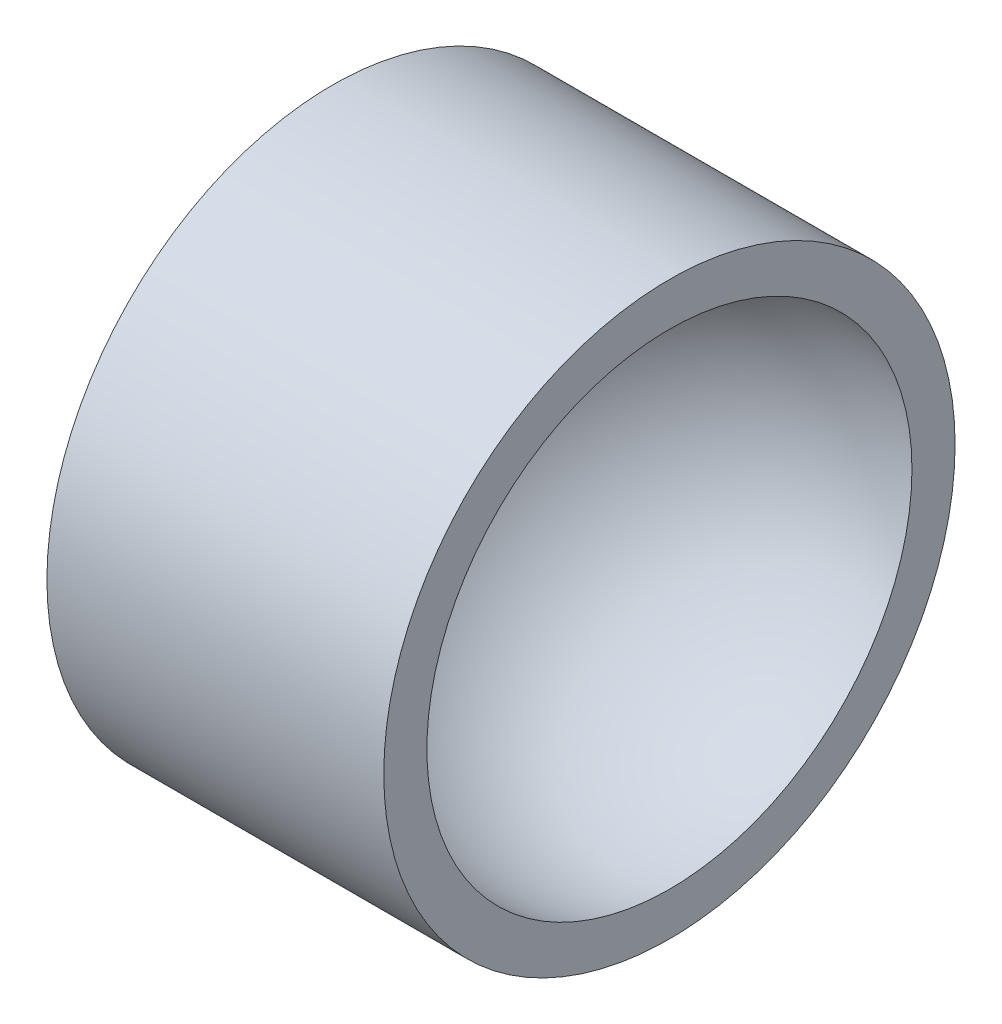
ISO-10303-21;
HEADER;
FILE_DESCRIPTION(('STEP AP214'),'2;1');
FILE_NAME('part.step','',(''),(''),'','','');
FILE_SCHEMA(('AUTOMOTIVE_DESIGN { 1 0 10303 214 1 1 1 1 }'));
ENDSEC;
DATA;
#1=APPLICATION_CONTEXT('core data for automotive mechanical design processes');
#2=APPLICATION_PROTOCOL_DEFINITION('international standard','automotive_design',2000,#1);
#3=PRODUCT_CONTEXT('',#1,'mechanical');
#4=PRODUCT('Part','Part','',(#3));
#5=PRODUCT_RELATED_PRODUCT_CATEGORY('part','',(#4));
#6=PRODUCT_DEFINITION_FORMATION('','',#4);
#7=PRODUCT_DEFINITION_CONTEXT('part definition',#1,'design');
#8=PRODUCT_DEFINITION('design','',#6,#7);
#9=PRODUCT_DEFINITION_SHAPE('','',#8);
#10=(LENGTH_UNIT() NAMED_UNIT(*) SI_UNIT(.MILLI.,.METRE.));
#11=(NAMED_UNIT(*) PLANE_ANGLE_UNIT() SI_UNIT($,.RADIAN.));
#12=(NAMED_UNIT(*) SI_UNIT($,.STERADIAN.) SOLID_ANGLE_UNIT());
#13=UNCERTAINTY_MEASURE_WITH_UNIT(LENGTH_MEASURE(1.E-05),#10,'distance_accuracy_value','');
#14=(GEOMETRIC_REPRESENTATION_CONTEXT(3) GLOBAL_UNCERTAINTY_ASSIGNED_CONTEXT((#13)) GLOBAL_UNIT_ASSIGNED_CONTEXT((#10,
#11,#12)) REPRESENTATION_CONTEXT('',''));
#15=CARTESIAN_POINT('',(0.,0.,0.));
#16=DIRECTION('',(0.,0.,1.));
#17=DIRECTION('',(1.,0.,0.));
#18=AXIS2_PLACEMENT_3D('',#15,#16,#17);
#19=CARTESIAN_POINT('',(0.,0.,0.));
#20=DIRECTION('',(1.,0.,0.));
#21=DIRECTION('',(0.,0.,-1.));
#22=AXIS2_PLACEMENT_3D('',#19,#20,#21);
#23=SPHERICAL_SURFACE('',#22,10.);
#24=CARTESIAN_POINT('',(1.57467527514397,0.,0.));
#25=DIRECTION('',(1.,0.,0.));
#26=DIRECTION('',(0.,0.,-1.));
#27=AXIS2_PLACEMENT_3D('',#24,#25,#26);
#28=CIRCLE('',#27,9.87524165668113);
#29=CARTESIAN_POINT('',(1.57467527514397,0.,-9.87524165668113));
#30=VERTEX_POINT('',#29);
#31=EDGE_CURVE('E10',#30,#30,#28,.T.);
#32=ORIENTED_EDGE('',*,*,#31,.T.);
#33=EDGE_LOOP('',(#32));
#34=FACE_BOUND('',#33,.T.);
#35=ADVANCED_FACE('F31',(#34),#23,.F.);
#36=CARTESIAN_POINT('',(1.57467527514397,0.,-9.87524165668113));
#37=DIRECTION('',(1.,0.,0.));
#38=DIRECTION('',(0.,0.,-1.));
#39=AXIS2_PLACEMENT_3D('',#36,#37,#38);
#40=PLANE('',#39);
#41=CARTESIAN_POINT('',(1.57467527514397,0.,0.));
#42=DIRECTION('',(1.,0.,0.));
#43=DIRECTION('',(0.,0.,-1.));
#44=AXIS2_PLACEMENT_3D('',#41,#42,#43);
#45=CIRCLE('',#44,11.630777084451);
#46=CARTESIAN_POINT('',(1.57467527514397,0.,-11.630777084451));
#47=VERTEX_POINT('',#46);
#48=EDGE_CURVE('E37',#47,#47,#45,.T.);
#49=ORIENTED_EDGE('',*,*,#48,.T.);
#50=EDGE_LOOP('',(#49));
#51=FACE_BOUND('',#50,.T.);
#52=ORIENTED_EDGE('',*,*,#31,.F.);
#53=EDGE_LOOP('',(#52));
#54=FACE_BOUND('',#53,.T.);
#55=ADVANCED_FACE('F57',(#51,#54),#40,.T.);
#56=CARTESIAN_POINT('',(-10.,0.,0.));
#57=DIRECTION('',(1.,0.,0.));
#58=DIRECTION('',(0.,0.,-1.));
#59=AXIS2_PLACEMENT_3D('',#56,#57,#58);
#60=CYLINDRICAL_SURFACE('',#59,11.630777084451);
#61=CARTESIAN_POINT('',(-12.1410360604145,0.,0.));
#62=DIRECTION('',(1.,0.,0.));
#63=DIRECTION('',(0.,0.,-1.));
#64=AXIS2_PLACEMENT_3D('',#61,#62,#63);
#65=CIRCLE('',#64,11.630777084451);
#66=CARTESIAN_POINT('',(-12.1410360604145,0.,-11.630777084451));
#67=VERTEX_POINT('',#66);
#68=EDGE_CURVE('E41',#67,#67,#65,.T.);
#69=ORIENTED_EDGE('',*,*,#68,.T.);
#70=EDGE_LOOP('',(#69));
#71=FACE_BOUND('',#70,.T.);
#72=ORIENTED_EDGE('',*,*,#48,.F.);
#73=EDGE_LOOP('',(#72));
#74=FACE_BOUND('',#73,.T.);
#75=ADVANCED_FACE('F48',(#71,#74),#60,.T.);
#76=CARTESIAN_POINT('',(-12.1410360604145,0.,-11.630777084451));
#77=DIRECTION('',(-1.,0.,0.));
#78=DIRECTION('',(0.,0.,1.));
#79=AXIS2_PLACEMENT_3D('',#76,#77,#78);
#80=PLANE('',#79);
#81=ORIENTED_EDGE('',*,*,#68,.F.);
#82=EDGE_LOOP('',(#81));
#83=FACE_BOUND('',#82,.T.);
#84=ADVANCED_FACE('F51',(#83),#80,.T.);
#85=CLOSED_SHELL('',(#35,#55,#75,#84));
#86=MANIFOLD_SOLID_BREP('B2',#85);
#87=ADVANCED_BREP_SHAPE_REPRESENTATION('',(#18,#86),#14);
#88=SHAPE_DEFINITION_REPRESENTATION(#9,#87);
ENDSEC;
END-ISO-10303-21;
